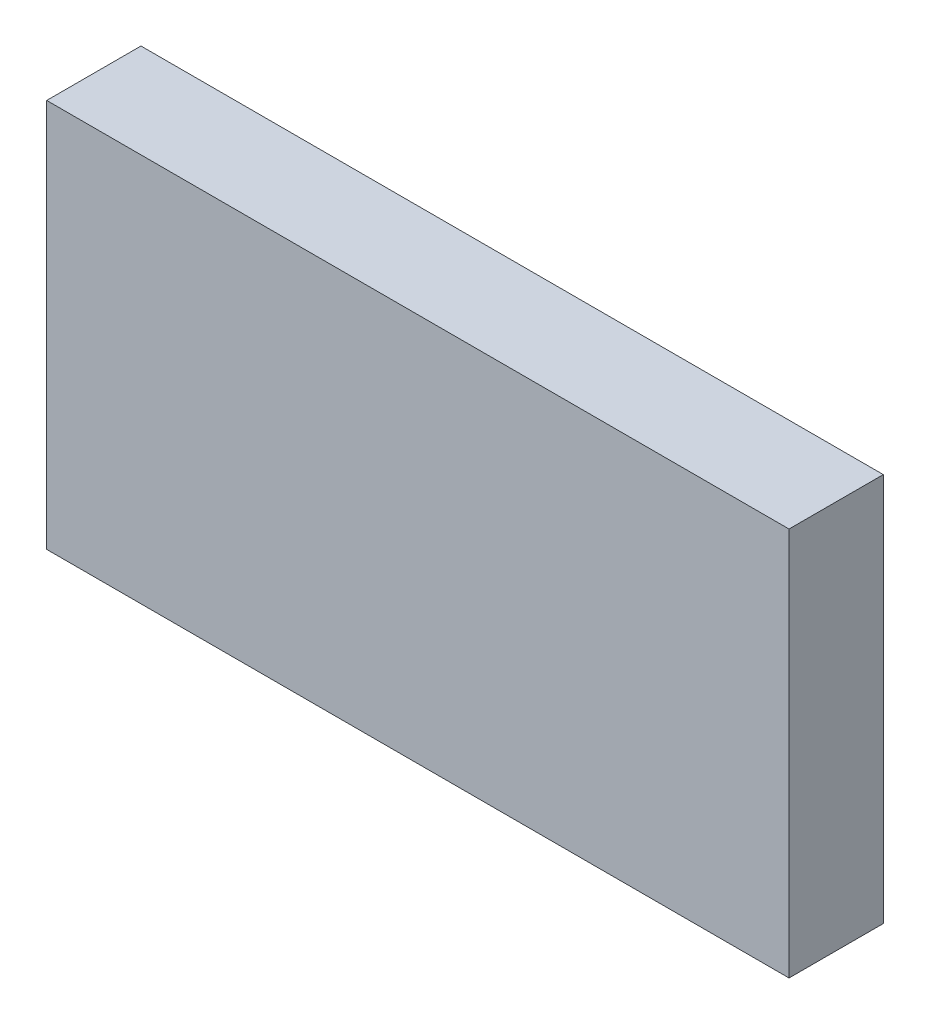
ISO-10303-21;
HEADER;
FILE_DESCRIPTION(('STEP AP214'),'2;1');
FILE_NAME('part.step','',(''),(''),'','','');
FILE_SCHEMA(('AUTOMOTIVE_DESIGN { 1 0 10303 214 1 1 1 1 }'));
ENDSEC;
DATA;
#1=APPLICATION_CONTEXT('core data for automotive mechanical design processes');
#2=APPLICATION_PROTOCOL_DEFINITION('international standard','automotive_design',2000,#1);
#3=PRODUCT_CONTEXT('',#1,'mechanical');
#4=PRODUCT('Part','Part','',(#3));
#5=PRODUCT_RELATED_PRODUCT_CATEGORY('part','',(#4));
#6=PRODUCT_DEFINITION_FORMATION('','',#4);
#7=PRODUCT_DEFINITION_CONTEXT('part definition',#1,'design');
#8=PRODUCT_DEFINITION('design','',#6,#7);
#9=PRODUCT_DEFINITION_SHAPE('','',#8);
#10=(LENGTH_UNIT() NAMED_UNIT(*) SI_UNIT(.MILLI.,.METRE.));
#11=(NAMED_UNIT(*) PLANE_ANGLE_UNIT() SI_UNIT($,.RADIAN.));
#12=(NAMED_UNIT(*) SI_UNIT($,.STERADIAN.) SOLID_ANGLE_UNIT());
#13=UNCERTAINTY_MEASURE_WITH_UNIT(LENGTH_MEASURE(1.E-05),#10,'distance_accuracy_value','');
#14=(GEOMETRIC_REPRESENTATION_CONTEXT(3) GLOBAL_UNCERTAINTY_ASSIGNED_CONTEXT((#13)) GLOBAL_UNIT_ASSIGNED_CONTEXT((#10,
#11,#12)) REPRESENTATION_CONTEXT('',''));
#15=CARTESIAN_POINT('',(0.,0.,0.));
#16=DIRECTION('',(0.,0.,1.));
#17=DIRECTION('',(1.,0.,0.));
#18=AXIS2_PLACEMENT_3D('',#15,#16,#17);
#19=CARTESIAN_POINT('',(-18.4527978636122,-7.84403230742271,1.03674100858028E-06));
#20=DIRECTION('',(0.,8.74227339409095E-08,-1.));
#21=DIRECTION('',(1.,0.,0.));
#22=AXIS2_PLACEMENT_3D('',#19,#20,#21);
#23=PLANE('',#22);
#24=DIRECTION('',(-1.,0.,0.));
#25=VECTOR('',#24,1.);
#26=CARTESIAN_POINT('',(-18.4527978636122,-6.19403230742271,1.18098851965148E-06));
#27=LINE('',#26,#25);
#28=CARTESIAN_POINT('',(-15.3027978636123,-6.19403230742271,1.18098851965148E-06));
#29=VERTEX_POINT('',#28);
#30=CARTESIAN_POINT('',(-21.6027978636122,-6.19403230742271,1.18098851965148E-06));
#31=VERTEX_POINT('',#30);
#32=EDGE_CURVE('E90',#29,#31,#27,.T.);
#33=ORIENTED_EDGE('',*,*,#32,.T.);
#34=DIRECTION('',(0.,-1.,-8.74227339409095E-08));
#35=VECTOR('',#34,1.);
#36=CARTESIAN_POINT('',(-21.6027978636122,-7.84403230742271,1.03674100858028E-06));
#37=LINE('',#36,#35);
#38=CARTESIAN_POINT('',(-21.6027978636122,-9.49403230742271,8.92493497509084E-07));
#39=VERTEX_POINT('',#38);
#40=EDGE_CURVE('E27',#31,#39,#37,.T.);
#41=ORIENTED_EDGE('',*,*,#40,.T.);
#42=DIRECTION('',(-1.,0.,0.));
#43=VECTOR('',#42,1.);
#44=CARTESIAN_POINT('',(-18.4527978636122,-9.49403230742271,8.92493497509084E-07));
#45=LINE('',#44,#43);
#46=CARTESIAN_POINT('',(-15.3027978636123,-9.49403230742271,8.92493497509084E-07));
#47=VERTEX_POINT('',#46);
#48=EDGE_CURVE('E78',#47,#39,#45,.T.);
#49=ORIENTED_EDGE('',*,*,#48,.F.);
#50=DIRECTION('',(0.,-1.,-8.74227339409095E-08));
#51=VECTOR('',#50,1.);
#52=CARTESIAN_POINT('',(-15.3027978636123,-7.84403230742271,1.03674100858028E-06));
#53=LINE('',#52,#51);
#54=EDGE_CURVE('E101',#29,#47,#53,.T.);
#55=ORIENTED_EDGE('',*,*,#54,.F.);
#56=EDGE_LOOP('',(#33,#41,#49,#55));
#57=FACE_BOUND('',#56,.T.);
#58=ADVANCED_FACE('F17',(#57),#23,.F.);
#59=CARTESIAN_POINT('',(-18.4527978636122,-7.84403223748453,-0.79999896325899));
#60=DIRECTION('',(0.,8.74227339409095E-08,-1.));
#61=DIRECTION('',(1.,0.,0.));
#62=AXIS2_PLACEMENT_3D('',#59,#60,#61);
#63=PLANE('',#62);
#64=DIRECTION('',(-1.,0.,0.));
#65=VECTOR('',#64,1.);
#66=CARTESIAN_POINT('',(-18.4527978636122,-6.19403223748453,-0.799998819011479));
#67=LINE('',#66,#65);
#68=CARTESIAN_POINT('',(-15.3027978636123,-6.19403223748453,-0.799998819011479));
#69=VERTEX_POINT('',#68);
#70=CARTESIAN_POINT('',(-21.6027978636122,-6.19403223748453,-0.799998819011479));
#71=VERTEX_POINT('',#70);
#72=EDGE_CURVE('E81',#69,#71,#67,.T.);
#73=ORIENTED_EDGE('',*,*,#72,.F.);
#74=DIRECTION('',(0.,-1.,-8.74227339409095E-08));
#75=VECTOR('',#74,1.);
#76=CARTESIAN_POINT('',(-15.3027978636123,-7.84403223748453,-0.79999896325899));
#77=LINE('',#76,#75);
#78=CARTESIAN_POINT('',(-15.3027978636123,-9.49403223748452,-0.799999107506501));
#79=VERTEX_POINT('',#78);
#80=EDGE_CURVE('E67',#69,#79,#77,.T.);
#81=ORIENTED_EDGE('',*,*,#80,.T.);
#82=DIRECTION('',(-1.,0.,0.));
#83=VECTOR('',#82,1.);
#84=CARTESIAN_POINT('',(-18.4527978636122,-9.49403223748452,-0.799999107506501));
#85=LINE('',#84,#83);
#86=CARTESIAN_POINT('',(-21.6027978636122,-9.49403223748452,-0.799999107506501));
#87=VERTEX_POINT('',#86);
#88=EDGE_CURVE('E111',#79,#87,#85,.T.);
#89=ORIENTED_EDGE('',*,*,#88,.T.);
#90=DIRECTION('',(0.,-1.,-8.74227339409095E-08));
#91=VECTOR('',#90,1.);
#92=CARTESIAN_POINT('',(-21.6027978636122,-7.84403223748452,-0.79999896325899));
#93=LINE('',#92,#91);
#94=EDGE_CURVE('E11',#71,#87,#93,.T.);
#95=ORIENTED_EDGE('',*,*,#94,.F.);
#96=EDGE_LOOP('',(#73,#81,#89,#95));
#97=FACE_BOUND('',#96,.T.);
#98=ADVANCED_FACE('F82',(#97),#63,.T.);
#99=CARTESIAN_POINT('',(-21.6027978636122,-7.84403223748452,-0.79999896325899));
#100=DIRECTION('',(-1.,0.,0.));
#101=DIRECTION('',(0.,8.74227339409095E-08,-1.));
#102=AXIS2_PLACEMENT_3D('',#99,#100,#101);
#103=PLANE('',#102);
#104=ORIENTED_EDGE('',*,*,#40,.F.);
#105=DIRECTION('',(0.,-8.74227339409095E-08,1.));
#106=VECTOR('',#105,1.);
#107=CARTESIAN_POINT('',(-21.6027978636122,-6.19403223748453,-0.799998819011479));
#108=LINE('',#107,#106);
#109=EDGE_CURVE('E86',#71,#31,#108,.T.);
#110=ORIENTED_EDGE('',*,*,#109,.F.);
#111=ORIENTED_EDGE('',*,*,#94,.T.);
#112=DIRECTION('',(0.,-8.74227339409095E-08,1.));
#113=VECTOR('',#112,1.);
#114=CARTESIAN_POINT('',(-21.6027978636122,-9.49403223748452,-0.799999107506501));
#115=LINE('',#114,#113);
#116=EDGE_CURVE('E108',#87,#39,#115,.T.);
#117=ORIENTED_EDGE('',*,*,#116,.T.);
#118=EDGE_LOOP('',(#104,#110,#111,#117));
#119=FACE_BOUND('',#118,.T.);
#120=ADVANCED_FACE('F140',(#119),#103,.T.);
#121=CARTESIAN_POINT('',(-18.4527978636122,-9.49403223748452,-0.799999107506501));
#122=DIRECTION('',(0.,1.,8.74227339409095E-08));
#123=DIRECTION('',(1.,0.,0.));
#124=AXIS2_PLACEMENT_3D('',#121,#122,#123);
#125=PLANE('',#124);
#126=ORIENTED_EDGE('',*,*,#48,.T.);
#127=ORIENTED_EDGE('',*,*,#116,.F.);
#128=ORIENTED_EDGE('',*,*,#88,.F.);
#129=DIRECTION('',(0.,-8.74227339409095E-08,1.));
#130=VECTOR('',#129,1.);
#131=CARTESIAN_POINT('',(-15.3027978636123,-9.49403223748452,-0.799999107506501));
#132=LINE('',#131,#130);
#133=EDGE_CURVE('E75',#79,#47,#132,.T.);
#134=ORIENTED_EDGE('',*,*,#133,.T.);
#135=EDGE_LOOP('',(#126,#127,#128,#134));
#136=FACE_BOUND('',#135,.T.);
#137=ADVANCED_FACE('F139',(#136),#125,.F.);
#138=CARTESIAN_POINT('',(-15.3027978636123,-7.84403223748453,-0.79999896325899));
#139=DIRECTION('',(-1.,0.,0.));
#140=DIRECTION('',(0.,8.74227339409095E-08,-1.));
#141=AXIS2_PLACEMENT_3D('',#138,#139,#140);
#142=PLANE('',#141);
#143=ORIENTED_EDGE('',*,*,#54,.T.);
#144=ORIENTED_EDGE('',*,*,#133,.F.);
#145=ORIENTED_EDGE('',*,*,#80,.F.);
#146=DIRECTION('',(0.,-8.74227339409095E-08,1.));
#147=VECTOR('',#146,1.);
#148=CARTESIAN_POINT('',(-15.3027978636123,-6.19403223748453,-0.799998819011479));
#149=LINE('',#148,#147);
#150=EDGE_CURVE('E72',#69,#29,#149,.T.);
#151=ORIENTED_EDGE('',*,*,#150,.T.);
#152=EDGE_LOOP('',(#143,#144,#145,#151));
#153=FACE_BOUND('',#152,.T.);
#154=ADVANCED_FACE('F70',(#153),#142,.F.);
#155=CARTESIAN_POINT('',(-18.4527978636122,-6.19403223748453,-0.799998819011479));
#156=DIRECTION('',(0.,1.,8.74227339409095E-08));
#157=DIRECTION('',(1.,0.,0.));
#158=AXIS2_PLACEMENT_3D('',#155,#156,#157);
#159=PLANE('',#158);
#160=ORIENTED_EDGE('',*,*,#32,.F.);
#161=ORIENTED_EDGE('',*,*,#150,.F.);
#162=ORIENTED_EDGE('',*,*,#72,.T.);
#163=ORIENTED_EDGE('',*,*,#109,.T.);
#164=EDGE_LOOP('',(#160,#161,#162,#163));
#165=FACE_BOUND('',#164,.T.);
#166=ADVANCED_FACE('F88',(#165),#159,.T.);
#167=CLOSED_SHELL('',(#58,#98,#120,#137,#154,#166));
#168=MANIFOLD_SOLID_BREP('B1',#167);
#169=ADVANCED_BREP_SHAPE_REPRESENTATION('',(#18,#168),#14);
#170=SHAPE_DEFINITION_REPRESENTATION(#9,#169);
ENDSEC;
END-ISO-10303-21;
